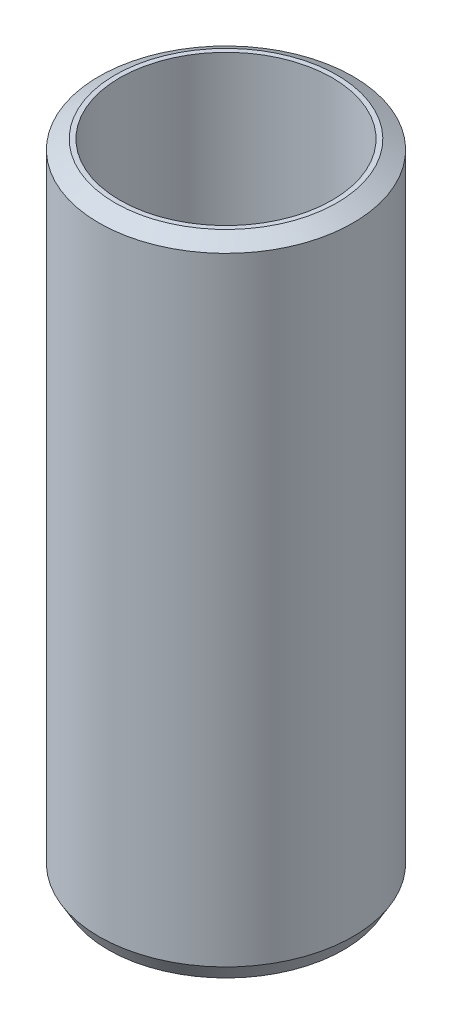
ISO-10303-21;
HEADER;
FILE_DESCRIPTION(('STEP AP214'),'2;1');
FILE_NAME('part.step','',(''),(''),'','','');
FILE_SCHEMA(('AUTOMOTIVE_DESIGN { 1 0 10303 214 1 1 1 1 }'));
ENDSEC;
DATA;
#1=APPLICATION_CONTEXT('core data for automotive mechanical design processes');
#2=APPLICATION_PROTOCOL_DEFINITION('international standard','automotive_design',2000,#1);
#3=PRODUCT_CONTEXT('',#1,'mechanical');
#4=PRODUCT('Part','Part','',(#3));
#5=PRODUCT_RELATED_PRODUCT_CATEGORY('part','',(#4));
#6=PRODUCT_DEFINITION_FORMATION('','',#4);
#7=PRODUCT_DEFINITION_CONTEXT('part definition',#1,'design');
#8=PRODUCT_DEFINITION('design','',#6,#7);
#9=PRODUCT_DEFINITION_SHAPE('','',#8);
#10=(LENGTH_UNIT() NAMED_UNIT(*) SI_UNIT(.MILLI.,.METRE.));
#11=(NAMED_UNIT(*) PLANE_ANGLE_UNIT() SI_UNIT($,.RADIAN.));
#12=(NAMED_UNIT(*) SI_UNIT($,.STERADIAN.) SOLID_ANGLE_UNIT());
#13=UNCERTAINTY_MEASURE_WITH_UNIT(LENGTH_MEASURE(1.E-05),#10,'distance_accuracy_value','');
#14=(GEOMETRIC_REPRESENTATION_CONTEXT(3) GLOBAL_UNCERTAINTY_ASSIGNED_CONTEXT((#13)) GLOBAL_UNIT_ASSIGNED_CONTEXT((#10,
#11,#12)) REPRESENTATION_CONTEXT('',''));
#15=CARTESIAN_POINT('',(0.,0.,0.));
#16=DIRECTION('',(0.,0.,1.));
#17=DIRECTION('',(1.,0.,0.));
#18=AXIS2_PLACEMENT_3D('',#15,#16,#17);
#19=CARTESIAN_POINT('',(0.,278.606057331024,0.));
#20=DIRECTION('',(0.,-1.,0.));
#21=DIRECTION('',(0.,0.,-1.));
#22=AXIS2_PLACEMENT_3D('',#19,#20,#21);
#23=CYLINDRICAL_SURFACE('',#22,55.);
#24=CARTESIAN_POINT('',(0.,274.575894943134,0.));
#25=DIRECTION('',(0.,1.,0.));
#26=DIRECTION('',(0.,0.,1.));
#27=AXIS2_PLACEMENT_3D('',#24,#25,#26);
#28=CIRCLE('',#27,55.);
#29=CARTESIAN_POINT('',(0.,274.575894943134,55.));
#30=VERTEX_POINT('',#29);
#31=EDGE_CURVE('E50',#30,#30,#28,.F.);
#32=ORIENTED_EDGE('',*,*,#31,.T.);
#33=EDGE_LOOP('',(#32));
#34=FACE_BOUND('',#33,.T.);
#35=CARTESIAN_POINT('',(0.,6.98044601857795,0.));
#36=DIRECTION('',(0.,1.,0.));
#37=DIRECTION('',(0.,0.,1.));
#38=AXIS2_PLACEMENT_3D('',#35,#36,#37);
#39=CIRCLE('',#38,55.);
#40=CARTESIAN_POINT('',(0.,6.98044601857795,55.));
#41=VERTEX_POINT('',#40);
#42=EDGE_CURVE('E51',#41,#41,#39,.T.);
#43=ORIENTED_EDGE('',*,*,#42,.T.);
#44=EDGE_LOOP('',(#43));
#45=FACE_BOUND('',#44,.T.);
#46=ADVANCED_FACE('F39',(#34,#45),#23,.T.);
#47=CARTESIAN_POINT('',(0.,278.606057331024,0.));
#48=DIRECTION('',(0.,1.,0.));
#49=DIRECTION('',(0.,0.,1.));
#50=AXIS2_PLACEMENT_3D('',#47,#48,#49);
#51=PLANE('',#50);
#52=CARTESIAN_POINT('',(0.,278.606057331024,0.));
#53=DIRECTION('',(0.,1.,0.));
#54=DIRECTION('',(0.,0.,1.));
#55=AXIS2_PLACEMENT_3D('',#52,#53,#54);
#56=CIRCLE('',#55,48.0195539814222);
#57=CARTESIAN_POINT('',(0.,278.606057331024,48.0195539814222));
#58=VERTEX_POINT('',#57);
#59=EDGE_CURVE('E54',#58,#58,#56,.T.);
#60=ORIENTED_EDGE('',*,*,#59,.T.);
#61=EDGE_LOOP('',(#60));
#62=FACE_BOUND('',#61,.T.);
#63=CARTESIAN_POINT('',(0.,278.606057331024,0.));
#64=DIRECTION('',(0.,1.,0.));
#65=DIRECTION('',(0.,0.,1.));
#66=AXIS2_PLACEMENT_3D('',#63,#64,#65);
#67=CIRCLE('',#66,45.9566121359544);
#68=CARTESIAN_POINT('',(0.,278.606057331024,45.9566121359544));
#69=VERTEX_POINT('',#68);
#70=EDGE_CURVE('E58',#69,#69,#67,.T.);
#71=ORIENTED_EDGE('',*,*,#70,.F.);
#72=EDGE_LOOP('',(#71));
#73=FACE_BOUND('',#72,.T.);
#74=ADVANCED_FACE('F69',(#62,#73),#51,.T.);
#75=CARTESIAN_POINT('',(0.,0.,0.));
#76=DIRECTION('',(0.,1.,0.));
#77=DIRECTION('',(0.,0.,1.));
#78=AXIS2_PLACEMENT_3D('',#75,#76,#77);
#79=PLANE('',#78);
#80=CARTESIAN_POINT('',(0.,0.,0.));
#81=DIRECTION('',(0.,1.,0.));
#82=DIRECTION('',(0.,0.,1.));
#83=AXIS2_PLACEMENT_3D('',#80,#81,#82);
#84=CIRCLE('',#83,50.9698376121104);
#85=CARTESIAN_POINT('',(0.,0.,50.9698376121104));
#86=VERTEX_POINT('',#85);
#87=EDGE_CURVE('E10',#86,#86,#84,.F.);
#88=ORIENTED_EDGE('',*,*,#87,.T.);
#89=EDGE_LOOP('',(#88));
#90=FACE_BOUND('',#89,.T.);
#91=CARTESIAN_POINT('',(0.,0.,0.));
#92=DIRECTION('',(0.,1.,0.));
#93=DIRECTION('',(0.,0.,1.));
#94=AXIS2_PLACEMENT_3D('',#91,#92,#93);
#95=CIRCLE('',#94,45.9566121359544);
#96=CARTESIAN_POINT('',(0.,0.,45.9566121359544));
#97=VERTEX_POINT('',#96);
#98=EDGE_CURVE('E63',#97,#97,#95,.T.);
#99=ORIENTED_EDGE('',*,*,#98,.T.);
#100=EDGE_LOOP('',(#99));
#101=FACE_BOUND('',#100,.T.);
#102=ADVANCED_FACE('F75',(#90,#101),#79,.F.);
#103=CARTESIAN_POINT('',(0.,278.606057331024,0.));
#104=DIRECTION('',(0.,-1.,0.));
#105=DIRECTION('',(0.,0.,-1.));
#106=AXIS2_PLACEMENT_3D('',#103,#104,#105);
#107=CYLINDRICAL_SURFACE('',#106,45.9566121359544);
#108=ORIENTED_EDGE('',*,*,#70,.T.);
#109=EDGE_LOOP('',(#108));
#110=FACE_BOUND('',#109,.T.);
#111=ORIENTED_EDGE('',*,*,#98,.F.);
#112=EDGE_LOOP('',(#111));
#113=FACE_BOUND('',#112,.T.);
#114=ADVANCED_FACE('F70',(#110,#113),#107,.F.);
#115=CARTESIAN_POINT('',(0.,278.606057331024,0.));
#116=DIRECTION('',(0.,-1.,0.));
#117=DIRECTION('',(0.,0.,-1.));
#118=AXIS2_PLACEMENT_3D('',#115,#116,#117);
#119=CONICAL_SURFACE('',#118,48.0195539814222,1.04719755119659);
#120=ORIENTED_EDGE('',*,*,#31,.F.);
#121=EDGE_LOOP('',(#120));
#122=FACE_BOUND('',#121,.T.);
#123=ORIENTED_EDGE('',*,*,#59,.F.);
#124=EDGE_LOOP('',(#123));
#125=FACE_BOUND('',#124,.T.);
#126=ADVANCED_FACE('F81',(#122,#125),#119,.T.);
#127=CARTESIAN_POINT('',(0.,6.98044601857795,0.));
#128=DIRECTION('',(0.,1.,0.));
#129=DIRECTION('',(0.,0.,1.));
#130=AXIS2_PLACEMENT_3D('',#127,#128,#129);
#131=CONICAL_SURFACE('',#130,55.,0.523598775598301);
#132=ORIENTED_EDGE('',*,*,#87,.F.);
#133=EDGE_LOOP('',(#132));
#134=FACE_BOUND('',#133,.T.);
#135=ORIENTED_EDGE('',*,*,#42,.F.);
#136=EDGE_LOOP('',(#135));
#137=FACE_BOUND('',#136,.T.);
#138=ADVANCED_FACE('F45',(#134,#137),#131,.T.);
#139=CLOSED_SHELL('',(#46,#74,#102,#114,#126,#138));
#140=MANIFOLD_SOLID_BREP('B2',#139);
#141=ADVANCED_BREP_SHAPE_REPRESENTATION('',(#18,#140),#14);
#142=SHAPE_DEFINITION_REPRESENTATION(#9,#141);
ENDSEC;
END-ISO-10303-21;
